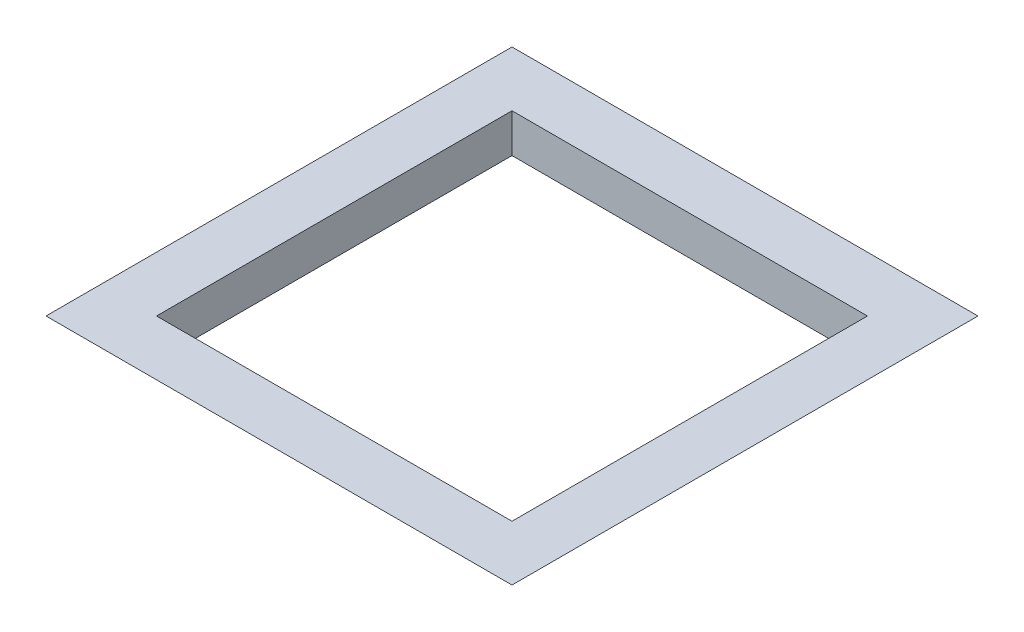
ISO-10303-21;
HEADER;
FILE_DESCRIPTION(('STEP AP214'),'2;1');
FILE_NAME('part.step','',(''),(''),'','','');
FILE_SCHEMA(('AUTOMOTIVE_DESIGN { 1 0 10303 214 1 1 1 1 }'));
ENDSEC;
DATA;
#1=APPLICATION_CONTEXT('core data for automotive mechanical design processes');
#2=APPLICATION_PROTOCOL_DEFINITION('international standard','automotive_design',2000,#1);
#3=PRODUCT_CONTEXT('',#1,'mechanical');
#4=PRODUCT('Part','Part','',(#3));
#5=PRODUCT_RELATED_PRODUCT_CATEGORY('part','',(#4));
#6=PRODUCT_DEFINITION_FORMATION('','',#4);
#7=PRODUCT_DEFINITION_CONTEXT('part definition',#1,'design');
#8=PRODUCT_DEFINITION('design','',#6,#7);
#9=PRODUCT_DEFINITION_SHAPE('','',#8);
#10=(LENGTH_UNIT() NAMED_UNIT(*) SI_UNIT(.MILLI.,.METRE.));
#11=(NAMED_UNIT(*) PLANE_ANGLE_UNIT() SI_UNIT($,.RADIAN.));
#12=(NAMED_UNIT(*) SI_UNIT($,.STERADIAN.) SOLID_ANGLE_UNIT());
#13=UNCERTAINTY_MEASURE_WITH_UNIT(LENGTH_MEASURE(1.E-05),#10,'distance_accuracy_value','');
#14=(GEOMETRIC_REPRESENTATION_CONTEXT(3) GLOBAL_UNCERTAINTY_ASSIGNED_CONTEXT((#13)) GLOBAL_UNIT_ASSIGNED_CONTEXT((#10,
#11,#12)) REPRESENTATION_CONTEXT('',''));
#15=CARTESIAN_POINT('',(0.,0.,0.));
#16=DIRECTION('',(0.,0.,1.));
#17=DIRECTION('',(1.,0.,0.));
#18=AXIS2_PLACEMENT_3D('',#15,#16,#17);
#19=CARTESIAN_POINT('',(0.,0.,0.));
#20=DIRECTION('',(-0.707106781186546,-0.707106781186549,0.));
#21=DIRECTION('',(0.707106781186549,-0.707106781186546,0.));
#22=AXIS2_PLACEMENT_3D('',#19,#20,#21);
#23=PLANE('',#22);
#24=DIRECTION('',(0.,0.,1.));
#25=VECTOR('',#24,1.);
#26=CARTESIAN_POINT('',(0.,0.,0.));
#27=LINE('',#26,#25);
#28=CARTESIAN_POINT('',(0.,0.,-130.));
#29=VERTEX_POINT('',#28);
#30=CARTESIAN_POINT('',(0.,0.,0.));
#31=VERTEX_POINT('',#30);
#32=EDGE_CURVE('E133',#29,#31,#27,.T.);
#33=ORIENTED_EDGE('',*,*,#32,.T.);
#34=DIRECTION('',(0.577350269189627,-0.577350269189624,-0.577350269189627));
#35=VECTOR('',#34,1.);
#36=CARTESIAN_POINT('',(0.,0.,0.));
#37=LINE('',#36,#35);
#38=CARTESIAN_POINT('',(-13.,13.,13.));
#39=VERTEX_POINT('',#38);
#40=EDGE_CURVE('E11',#39,#31,#37,.T.);
#41=ORIENTED_EDGE('',*,*,#40,.F.);
#42=DIRECTION('',(0.,0.,-1.));
#43=VECTOR('',#42,1.);
#44=CARTESIAN_POINT('',(-13.,13.,0.));
#45=LINE('',#44,#43);
#46=CARTESIAN_POINT('',(-13.,13.,-143.));
#47=VERTEX_POINT('',#46);
#48=EDGE_CURVE('E144',#47,#39,#45,.F.);
#49=ORIENTED_EDGE('',*,*,#48,.F.);
#50=DIRECTION('',(0.577350269189627,-0.577350269189624,0.577350269189627));
#51=VECTOR('',#50,1.);
#52=CARTESIAN_POINT('',(43.3333333333334,-43.3333333333333,-86.6666666666666));
#53=LINE('',#52,#51);
#54=EDGE_CURVE('E146',#47,#29,#53,.T.);
#55=ORIENTED_EDGE('',*,*,#54,.T.);
#56=EDGE_LOOP('',(#33,#41,#49,#55));
#57=FACE_BOUND('',#56,.T.);
#58=ADVANCED_FACE('F33',(#57),#23,.T.);
#59=CARTESIAN_POINT('',(0.,0.,0.));
#60=DIRECTION('',(0.,-0.707106781186549,0.707106781186546));
#61=DIRECTION('',(0.,-0.707106781186546,-0.707106781186549));
#62=AXIS2_PLACEMENT_3D('',#59,#60,#61);
#63=PLANE('',#62);
#64=DIRECTION('',(1.,0.,0.));
#65=VECTOR('',#64,1.);
#66=CARTESIAN_POINT('',(0.,0.,0.));
#67=LINE('',#66,#65);
#68=CARTESIAN_POINT('',(130.,0.,0.));
#69=VERTEX_POINT('',#68);
#70=EDGE_CURVE('E139',#31,#69,#67,.T.);
#71=ORIENTED_EDGE('',*,*,#70,.T.);
#72=DIRECTION('',(-0.577350269189627,-0.577350269189624,-0.577350269189627));
#73=VECTOR('',#72,1.);
#74=CARTESIAN_POINT('',(130.,0.,0.));
#75=LINE('',#74,#73);
#76=CARTESIAN_POINT('',(143.,13.,13.));
#77=VERTEX_POINT('',#76);
#78=EDGE_CURVE('E42',#77,#69,#75,.T.);
#79=ORIENTED_EDGE('',*,*,#78,.F.);
#80=DIRECTION('',(-1.,0.,0.));
#81=VECTOR('',#80,1.);
#82=CARTESIAN_POINT('',(0.,13.,13.));
#83=LINE('',#82,#81);
#84=EDGE_CURVE('E156',#39,#77,#83,.F.);
#85=ORIENTED_EDGE('',*,*,#84,.F.);
#86=ORIENTED_EDGE('',*,*,#40,.T.);
#87=EDGE_LOOP('',(#71,#79,#85,#86));
#88=FACE_BOUND('',#87,.T.);
#89=ADVANCED_FACE('F35',(#88),#63,.T.);
#90=CARTESIAN_POINT('',(130.,0.,0.));
#91=DIRECTION('',(0.707106781186546,-0.707106781186549,0.));
#92=DIRECTION('',(0.707106781186549,0.707106781186546,0.));
#93=AXIS2_PLACEMENT_3D('',#90,#91,#92);
#94=PLANE('',#93);
#95=DIRECTION('',(0.,0.,-1.));
#96=VECTOR('',#95,1.);
#97=CARTESIAN_POINT('',(130.,0.,0.));
#98=LINE('',#97,#96);
#99=CARTESIAN_POINT('',(130.,0.,-130.));
#100=VERTEX_POINT('',#99);
#101=EDGE_CURVE('E141',#69,#100,#98,.T.);
#102=ORIENTED_EDGE('',*,*,#101,.T.);
#103=DIRECTION('',(-0.577350269189627,-0.577350269189624,0.577350269189627));
#104=VECTOR('',#103,1.);
#105=CARTESIAN_POINT('',(86.6666666666666,-43.3333333333333,-86.6666666666666));
#106=LINE('',#105,#104);
#107=CARTESIAN_POINT('',(143.,13.,-143.));
#108=VERTEX_POINT('',#107);
#109=EDGE_CURVE('E149',#108,#100,#106,.T.);
#110=ORIENTED_EDGE('',*,*,#109,.F.);
#111=DIRECTION('',(0.,0.,1.));
#112=VECTOR('',#111,1.);
#113=CARTESIAN_POINT('',(143.,13.,0.));
#114=LINE('',#113,#112);
#115=EDGE_CURVE('E157',#77,#108,#114,.F.);
#116=ORIENTED_EDGE('',*,*,#115,.F.);
#117=ORIENTED_EDGE('',*,*,#78,.T.);
#118=EDGE_LOOP('',(#102,#110,#116,#117));
#119=FACE_BOUND('',#118,.T.);
#120=ADVANCED_FACE('F175',(#119),#94,.T.);
#121=CARTESIAN_POINT('',(0.,0.,-130.));
#122=DIRECTION('',(0.,-0.707106781186549,-0.707106781186546));
#123=DIRECTION('',(0.,0.707106781186546,-0.707106781186549));
#124=AXIS2_PLACEMENT_3D('',#121,#122,#123);
#125=PLANE('',#124);
#126=DIRECTION('',(-1.,0.,0.));
#127=VECTOR('',#126,1.);
#128=CARTESIAN_POINT('',(0.,0.,-130.));
#129=LINE('',#128,#127);
#130=EDGE_CURVE('E143',#100,#29,#129,.T.);
#131=ORIENTED_EDGE('',*,*,#130,.T.);
#132=ORIENTED_EDGE('',*,*,#54,.F.);
#133=DIRECTION('',(1.,0.,0.));
#134=VECTOR('',#133,1.);
#135=CARTESIAN_POINT('',(0.,13.,-143.));
#136=LINE('',#135,#134);
#137=EDGE_CURVE('E37',#108,#47,#136,.F.);
#138=ORIENTED_EDGE('',*,*,#137,.F.);
#139=ORIENTED_EDGE('',*,*,#109,.T.);
#140=EDGE_LOOP('',(#131,#132,#138,#139));
#141=FACE_BOUND('',#140,.T.);
#142=ADVANCED_FACE('F167',(#141),#125,.T.);
#143=CARTESIAN_POINT('',(0.,13.,0.));
#144=DIRECTION('',(0.,-1.,0.));
#145=DIRECTION('',(0.,0.,-1.));
#146=AXIS2_PLACEMENT_3D('',#143,#144,#145);
#147=PLANE('',#146);
#148=DIRECTION('',(1.,0.,0.));
#149=VECTOR('',#148,1.);
#150=CARTESIAN_POINT('',(5.5,13.,-5.49999999999995));
#151=LINE('',#150,#149);
#152=CARTESIAN_POINT('',(5.5,13.,-5.49999999999995));
#153=VERTEX_POINT('',#152);
#154=CARTESIAN_POINT('',(124.5,13.,-5.49999999999995));
#155=VERTEX_POINT('',#154);
#156=EDGE_CURVE('E127',#153,#155,#151,.T.);
#157=ORIENTED_EDGE('',*,*,#156,.F.);
#158=DIRECTION('',(0.,0.,1.));
#159=VECTOR('',#158,1.);
#160=CARTESIAN_POINT('',(5.49999999999997,13.,-124.5));
#161=LINE('',#160,#159);
#162=CARTESIAN_POINT('',(5.49999999999997,13.,-124.5));
#163=VERTEX_POINT('',#162);
#164=EDGE_CURVE('E50',#163,#153,#161,.T.);
#165=ORIENTED_EDGE('',*,*,#164,.F.);
#166=DIRECTION('',(-1.,0.,0.));
#167=VECTOR('',#166,1.);
#168=CARTESIAN_POINT('',(5.49999999999997,13.,-124.5));
#169=LINE('',#168,#167);
#170=CARTESIAN_POINT('',(124.5,13.,-124.5));
#171=VERTEX_POINT('',#170);
#172=EDGE_CURVE('E118',#171,#163,#169,.T.);
#173=ORIENTED_EDGE('',*,*,#172,.F.);
#174=DIRECTION('',(0.,0.,-1.));
#175=VECTOR('',#174,1.);
#176=CARTESIAN_POINT('',(124.5,13.,-124.5));
#177=LINE('',#176,#175);
#178=EDGE_CURVE('E121',#155,#171,#177,.T.);
#179=ORIENTED_EDGE('',*,*,#178,.F.);
#180=EDGE_LOOP('',(#157,#165,#173,#179));
#181=FACE_BOUND('',#180,.T.);
#182=ORIENTED_EDGE('',*,*,#48,.T.);
#183=ORIENTED_EDGE('',*,*,#84,.T.);
#184=ORIENTED_EDGE('',*,*,#115,.T.);
#185=ORIENTED_EDGE('',*,*,#137,.T.);
#186=EDGE_LOOP('',(#182,#183,#184,#185));
#187=FACE_BOUND('',#186,.T.);
#188=ADVANCED_FACE('F163',(#181,#187),#147,.F.);
#189=CARTESIAN_POINT('',(0.,0.,0.));
#190=DIRECTION('',(0.,-1.,0.));
#191=DIRECTION('',(0.,0.,-1.));
#192=AXIS2_PLACEMENT_3D('',#189,#190,#191);
#193=PLANE('',#192);
#194=DIRECTION('',(0.,0.,1.));
#195=VECTOR('',#194,1.);
#196=CARTESIAN_POINT('',(5.49999999999997,0.,-124.5));
#197=LINE('',#196,#195);
#198=CARTESIAN_POINT('',(5.49999999999997,0.,-124.5));
#199=VERTEX_POINT('',#198);
#200=CARTESIAN_POINT('',(5.5,0.,-5.49999999999995));
#201=VERTEX_POINT('',#200);
#202=EDGE_CURVE('E102',#199,#201,#197,.T.);
#203=ORIENTED_EDGE('',*,*,#202,.T.);
#204=DIRECTION('',(1.,0.,0.));
#205=VECTOR('',#204,1.);
#206=CARTESIAN_POINT('',(5.5,0.,-5.49999999999995));
#207=LINE('',#206,#205);
#208=CARTESIAN_POINT('',(124.5,0.,-5.49999999999995));
#209=VERTEX_POINT('',#208);
#210=EDGE_CURVE('E111',#201,#209,#207,.T.);
#211=ORIENTED_EDGE('',*,*,#210,.T.);
#212=DIRECTION('',(0.,0.,-1.));
#213=VECTOR('',#212,1.);
#214=CARTESIAN_POINT('',(124.5,0.,-124.5));
#215=LINE('',#214,#213);
#216=CARTESIAN_POINT('',(124.5,0.,-124.5));
#217=VERTEX_POINT('',#216);
#218=EDGE_CURVE('E58',#209,#217,#215,.T.);
#219=ORIENTED_EDGE('',*,*,#218,.T.);
#220=DIRECTION('',(-1.,0.,0.));
#221=VECTOR('',#220,1.);
#222=CARTESIAN_POINT('',(5.49999999999997,0.,-124.5));
#223=LINE('',#222,#221);
#224=EDGE_CURVE('E108',#217,#199,#223,.T.);
#225=ORIENTED_EDGE('',*,*,#224,.T.);
#226=EDGE_LOOP('',(#203,#211,#219,#225));
#227=FACE_BOUND('',#226,.T.);
#228=ORIENTED_EDGE('',*,*,#32,.F.);
#229=ORIENTED_EDGE('',*,*,#130,.F.);
#230=ORIENTED_EDGE('',*,*,#101,.F.);
#231=ORIENTED_EDGE('',*,*,#70,.F.);
#232=EDGE_LOOP('',(#228,#229,#230,#231));
#233=FACE_BOUND('',#232,.T.);
#234=ADVANCED_FACE('F115',(#227,#233),#193,.T.);
#235=CARTESIAN_POINT('',(5.49999999999997,0.,-124.5));
#236=DIRECTION('',(-1.,0.,0.));
#237=DIRECTION('',(0.,0.,1.));
#238=AXIS2_PLACEMENT_3D('',#235,#236,#237);
#239=PLANE('',#238);
#240=ORIENTED_EDGE('',*,*,#164,.T.);
#241=DIRECTION('',(0.,1.,0.));
#242=VECTOR('',#241,1.);
#243=CARTESIAN_POINT('',(5.5,0.,-5.49999999999995));
#244=LINE('',#243,#242);
#245=EDGE_CURVE('E98',#201,#153,#244,.T.);
#246=ORIENTED_EDGE('',*,*,#245,.F.);
#247=ORIENTED_EDGE('',*,*,#202,.F.);
#248=DIRECTION('',(0.,1.,0.));
#249=VECTOR('',#248,1.);
#250=CARTESIAN_POINT('',(5.49999999999997,0.,-124.5));
#251=LINE('',#250,#249);
#252=EDGE_CURVE('E131',#199,#163,#251,.T.);
#253=ORIENTED_EDGE('',*,*,#252,.T.);
#254=EDGE_LOOP('',(#240,#246,#247,#253));
#255=FACE_BOUND('',#254,.T.);
#256=ADVANCED_FACE('F100',(#255),#239,.F.);
#257=CARTESIAN_POINT('',(5.49999999999997,0.,-124.5));
#258=DIRECTION('',(0.,0.,-1.));
#259=DIRECTION('',(-1.,0.,0.));
#260=AXIS2_PLACEMENT_3D('',#257,#258,#259);
#261=PLANE('',#260);
#262=ORIENTED_EDGE('',*,*,#172,.T.);
#263=ORIENTED_EDGE('',*,*,#252,.F.);
#264=ORIENTED_EDGE('',*,*,#224,.F.);
#265=DIRECTION('',(0.,1.,0.));
#266=VECTOR('',#265,1.);
#267=CARTESIAN_POINT('',(124.5,0.,-124.5));
#268=LINE('',#267,#266);
#269=EDGE_CURVE('E134',#217,#171,#268,.T.);
#270=ORIENTED_EDGE('',*,*,#269,.T.);
#271=EDGE_LOOP('',(#262,#263,#264,#270));
#272=FACE_BOUND('',#271,.T.);
#273=ADVANCED_FACE('F182',(#272),#261,.F.);
#274=CARTESIAN_POINT('',(124.5,0.,-124.5));
#275=DIRECTION('',(1.,0.,0.));
#276=DIRECTION('',(0.,0.,-1.));
#277=AXIS2_PLACEMENT_3D('',#274,#275,#276);
#278=PLANE('',#277);
#279=ORIENTED_EDGE('',*,*,#178,.T.);
#280=ORIENTED_EDGE('',*,*,#269,.F.);
#281=ORIENTED_EDGE('',*,*,#218,.F.);
#282=DIRECTION('',(0.,1.,0.));
#283=VECTOR('',#282,1.);
#284=CARTESIAN_POINT('',(124.5,0.,-5.49999999999995));
#285=LINE('',#284,#283);
#286=EDGE_CURVE('E107',#209,#155,#285,.T.);
#287=ORIENTED_EDGE('',*,*,#286,.T.);
#288=EDGE_LOOP('',(#279,#280,#281,#287));
#289=FACE_BOUND('',#288,.T.);
#290=ADVANCED_FACE('F225',(#289),#278,.F.);
#291=CARTESIAN_POINT('',(5.5,0.,-5.49999999999995));
#292=DIRECTION('',(0.,0.,1.));
#293=DIRECTION('',(1.,0.,0.));
#294=AXIS2_PLACEMENT_3D('',#291,#292,#293);
#295=PLANE('',#294);
#296=ORIENTED_EDGE('',*,*,#156,.T.);
#297=ORIENTED_EDGE('',*,*,#286,.F.);
#298=ORIENTED_EDGE('',*,*,#210,.F.);
#299=ORIENTED_EDGE('',*,*,#245,.T.);
#300=EDGE_LOOP('',(#296,#297,#298,#299));
#301=FACE_BOUND('',#300,.T.);
#302=ADVANCED_FACE('F112',(#301),#295,.F.);
#303=CLOSED_SHELL('',(#58,#89,#120,#142,#188,#234,#256,#273,#290,#302));
#304=MANIFOLD_SOLID_BREP('B2',#303);
#305=ADVANCED_BREP_SHAPE_REPRESENTATION('',(#18,#304),#14);
#306=SHAPE_DEFINITION_REPRESENTATION(#9,#305);
ENDSEC;
END-ISO-10303-21;
